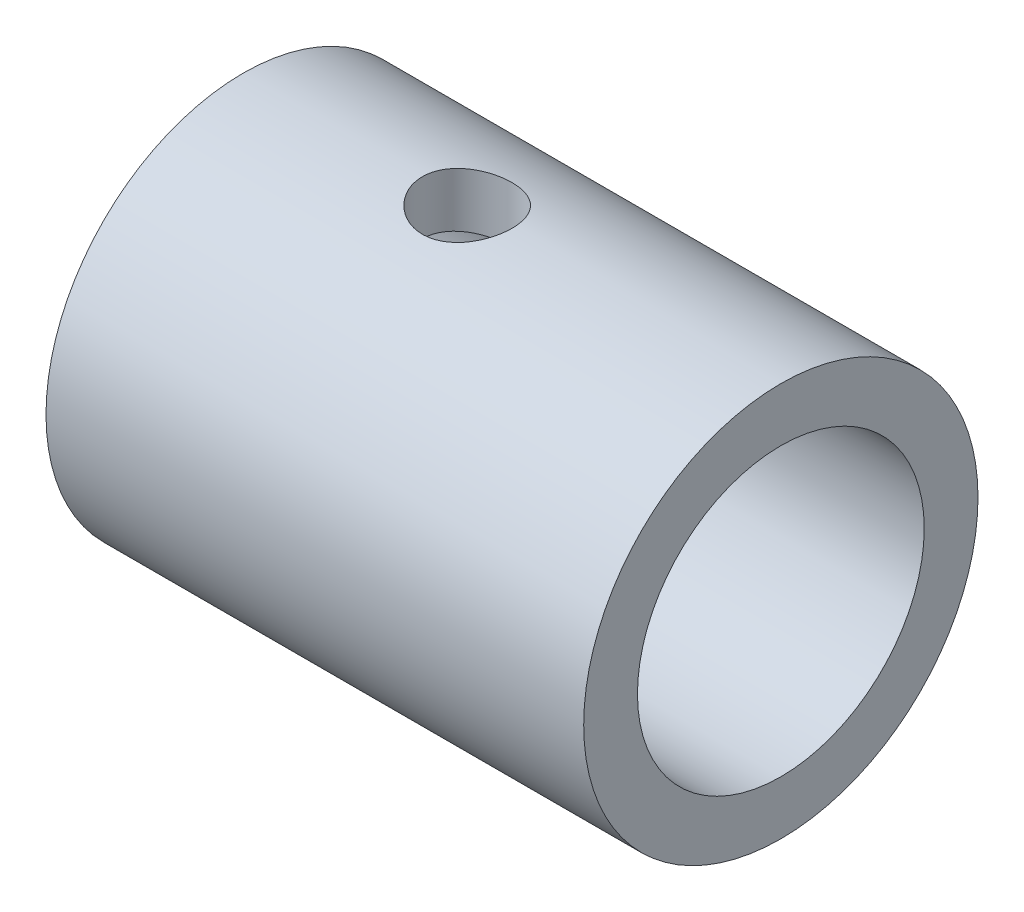
ISO-10303-21;
HEADER;
FILE_DESCRIPTION(('STEP AP214'),'2;1');
FILE_NAME('part.step','',(''),(''),'','','');
FILE_SCHEMA(('AUTOMOTIVE_DESIGN { 1 0 10303 214 1 1 1 1 }'));
ENDSEC;
DATA;
#1=APPLICATION_CONTEXT('core data for automotive mechanical design processes');
#2=APPLICATION_PROTOCOL_DEFINITION('international standard','automotive_design',2000,#1);
#3=PRODUCT_CONTEXT('',#1,'mechanical');
#4=PRODUCT('Part','Part','',(#3));
#5=PRODUCT_RELATED_PRODUCT_CATEGORY('part','',(#4));
#6=PRODUCT_DEFINITION_FORMATION('','',#4);
#7=PRODUCT_DEFINITION_CONTEXT('part definition',#1,'design');
#8=PRODUCT_DEFINITION('design','',#6,#7);
#9=PRODUCT_DEFINITION_SHAPE('','',#8);
#10=(LENGTH_UNIT() NAMED_UNIT(*) SI_UNIT(.MILLI.,.METRE.));
#11=(NAMED_UNIT(*) PLANE_ANGLE_UNIT() SI_UNIT($,.RADIAN.));
#12=(NAMED_UNIT(*) SI_UNIT($,.STERADIAN.) SOLID_ANGLE_UNIT());
#13=UNCERTAINTY_MEASURE_WITH_UNIT(LENGTH_MEASURE(1.E-05),#10,'distance_accuracy_value','');
#14=(GEOMETRIC_REPRESENTATION_CONTEXT(3) GLOBAL_UNCERTAINTY_ASSIGNED_CONTEXT((#13)) GLOBAL_UNIT_ASSIGNED_CONTEXT((#10,
#11,#12)) REPRESENTATION_CONTEXT('',''));
#15=CARTESIAN_POINT('',(0.,0.,0.));
#16=DIRECTION('',(0.,0.,1.));
#17=DIRECTION('',(1.,0.,0.));
#18=AXIS2_PLACEMENT_3D('',#15,#16,#17);
#19=CARTESIAN_POINT('',(-30.,0.,0.));
#20=DIRECTION('',(1.,0.,0.));
#21=DIRECTION('',(0.,0.,-1.));
#22=AXIS2_PLACEMENT_3D('',#19,#20,#21);
#23=CYLINDRICAL_SURFACE('',#22,11.);
#24=CARTESIAN_POINT('',(-30.,0.,0.));
#25=DIRECTION('',(1.,0.,0.));
#26=DIRECTION('',(0.,0.,-1.));
#27=AXIS2_PLACEMENT_3D('',#24,#25,#26);
#28=CIRCLE('',#27,11.);
#29=CARTESIAN_POINT('',(-30.,0.,-11.));
#30=VERTEX_POINT('',#29);
#31=EDGE_CURVE('E10',#30,#30,#28,.T.);
#32=ORIENTED_EDGE('',*,*,#31,.T.);
#33=EDGE_LOOP('',(#32));
#34=FACE_BOUND('',#33,.T.);
#35=CARTESIAN_POINT('',(0.,0.,0.));
#36=DIRECTION('',(1.,0.,0.));
#37=DIRECTION('',(0.,0.,-1.));
#38=AXIS2_PLACEMENT_3D('',#35,#36,#37);
#39=CIRCLE('',#38,11.);
#40=CARTESIAN_POINT('',(0.,0.,-11.));
#41=VERTEX_POINT('',#40);
#42=EDGE_CURVE('E44',#41,#41,#39,.T.);
#43=ORIENTED_EDGE('',*,*,#42,.F.);
#44=EDGE_LOOP('',(#43));
#45=FACE_BOUND('',#44,.T.);
#46=CARTESIAN_POINT('',(-15.,11.,0.));
#47=CARTESIAN_POINT('',(-15.0000045318264,10.9999974735185,0.138518278596904));
#48=CARTESIAN_POINT('',(-15.0115512275769,10.9973570934613,0.277090172258008));
#49=CARTESIAN_POINT('',(-15.0573794760617,10.987079320306,0.550288594599323));
#50=CARTESIAN_POINT('',(-15.0916763959553,10.9794385496265,0.68491239222073));
#51=CARTESIAN_POINT('',(-15.1818680486319,10.9600095312294,0.946227671984916));
#52=CARTESIAN_POINT('',(-15.2377393279807,10.9482257885674,1.07292759495647));
#53=CARTESIAN_POINT('',(-15.3694171133809,10.921778201627,1.31515227582566));
#54=CARTESIAN_POINT('',(-15.4452234208424,10.9071143860398,1.43067714503182));
#55=CARTESIAN_POINT('',(-15.6160020446067,10.8762265816814,1.64926760444638));
#56=CARTESIAN_POINT('',(-15.711252573475,10.8599819758326,1.75211293892049));
#57=CARTESIAN_POINT('',(-15.9176189741372,10.827906511833,1.9405138981661));
#58=CARTESIAN_POINT('',(-16.0287363506945,10.8120756930933,2.02606788121784));
#59=CARTESIAN_POINT('',(-16.2653320552837,10.7824158369221,2.17844599401787));
#60=CARTESIAN_POINT('',(-16.3909669963058,10.7686131580577,2.24503254356575));
#61=CARTESIAN_POINT('',(-16.6520095005816,10.7448696147509,2.3560606971787));
#62=CARTESIAN_POINT('',(-16.7874157920616,10.7349282488168,2.40050517717749));
#63=CARTESIAN_POINT('',(-17.0617591871165,10.7202434469831,2.46525349412718));
#64=CARTESIAN_POINT('',(-17.2005992631225,10.715415797339,2.48594892680754));
#65=CARTESIAN_POINT('',(-17.4798582272131,10.7112523406768,2.50382988451487));
#66=CARTESIAN_POINT('',(-17.6202769026623,10.711915802658,2.50101853886552));
#67=CARTESIAN_POINT('',(-17.8957728833487,10.7185835035919,2.47228016958762));
#68=CARTESIAN_POINT('',(-18.0309009061949,10.7244819412976,2.44681104599438));
#69=CARTESIAN_POINT('',(-18.2949144861548,10.7407873672743,2.37420684920502));
#70=CARTESIAN_POINT('',(-18.4237996676272,10.7511946264744,2.32707047404288));
#71=CARTESIAN_POINT('',(-18.6729406718105,10.7754474384537,2.21205734402544));
#72=CARTESIAN_POINT('',(-18.7931135177637,10.7893215597825,2.14400712086008));
#73=CARTESIAN_POINT('',(-19.0205025531111,10.8189276843241,1.98921977920408));
#74=CARTESIAN_POINT('',(-19.1277168402639,10.8346599596346,1.90247992237134));
#75=CARTESIAN_POINT('',(-19.328778561821,10.8666615287251,1.71036518003516));
#76=CARTESIAN_POINT('',(-19.4222544265163,10.882934773515,1.60460166742828));
#77=CARTESIAN_POINT('',(-19.5902058887071,10.9138502597158,1.37871229840972));
#78=CARTESIAN_POINT('',(-19.6646810866995,10.9284924668293,1.2585861400908));
#79=CARTESIAN_POINT('',(-19.7926203879715,10.9545497424637,1.00690799179916));
#80=CARTESIAN_POINT('',(-19.8460327736223,10.9659568484873,0.87532883434816));
#81=CARTESIAN_POINT('',(-19.9298840058679,10.9841998956698,0.6047451224917));
#82=CARTESIAN_POINT('',(-19.9603264658222,10.9910365557784,0.465741739663722));
#83=CARTESIAN_POINT('',(-19.9968262374727,10.9992650071756,0.187439840192734));
#84=CARTESIAN_POINT('',(-20.0033906913167,11.0007700184113,0.0482110923370396));
#85=CARTESIAN_POINT('',(-19.9933269601471,10.9984842255063,-0.229353886680102));
#86=CARTESIAN_POINT('',(-19.976700480594,10.9946938107912,-0.367690182720857));
#87=CARTESIAN_POINT('',(-19.9211468330946,10.9823148103741,-0.637841677218458));
#88=CARTESIAN_POINT('',(-19.8824884535563,10.973784087055,-0.769715036814425));
#89=CARTESIAN_POINT('',(-19.7842689725429,10.9528806132367,-1.0251039308776));
#90=CARTESIAN_POINT('',(-19.7247059957467,10.9405075180554,-1.14861871432289));
#91=CARTESIAN_POINT('',(-19.5853308564447,10.9130143275095,-1.38586085256056));
#92=CARTESIAN_POINT('',(-19.5052243732268,10.8978552985532,-1.49941068522719));
#93=CARTESIAN_POINT('',(-19.3274206715598,10.866546095646,-1.71163773579052));
#94=CARTESIAN_POINT('',(-19.2297209734532,10.8503957821912,-1.8103128535797));
#95=CARTESIAN_POINT('',(-19.0171690348666,10.8185287714487,-1.99201706218096));
#96=CARTESIAN_POINT('',(-18.9020127582132,10.8028272119253,-2.07469366594062));
#97=CARTESIAN_POINT('',(-18.6591536093297,10.7740023321604,-2.21953814406552));
#98=CARTESIAN_POINT('',(-18.5314512920404,10.7608788979592,-2.28170692501017));
#99=CARTESIAN_POINT('',(-18.2678195304311,10.7388274870674,-2.38333597241927));
#100=CARTESIAN_POINT('',(-18.1319426762567,10.7298753781702,-2.42292716221704));
#101=CARTESIAN_POINT('',(-17.8552330933009,10.7171411058581,-2.47865258340365));
#102=CARTESIAN_POINT('',(-17.7144012348636,10.7133580391079,-2.49479091341614));
#103=CARTESIAN_POINT('',(-17.4353413806891,10.7114502943222,-2.50296739214165));
#104=CARTESIAN_POINT('',(-17.2971304006664,10.7131941458177,-2.49556548501071));
#105=CARTESIAN_POINT('',(-17.0239810898117,10.7218446846914,-2.45813115403283));
#106=CARTESIAN_POINT('',(-16.8890427138895,10.7287513008948,-2.42809904217009));
#107=CARTESIAN_POINT('',(-16.6267566026337,10.7468826027048,-2.34653692360609));
#108=CARTESIAN_POINT('',(-16.4993803088585,10.758089666867,-2.29509457527995));
#109=CARTESIAN_POINT('',(-16.2549852930994,10.783564723281,-2.1722453660688));
#110=CARTESIAN_POINT('',(-16.1379677496745,10.7978330631966,-2.10083623731223));
#111=CARTESIAN_POINT('',(-15.9148655723447,10.828211072634,-1.93824996891049));
#112=CARTESIAN_POINT('',(-15.8090742777926,10.8443540558786,-1.84667645642834));
#113=CARTESIAN_POINT('',(-15.614176814918,10.8764454859305,-1.64715628932418));
#114=CARTESIAN_POINT('',(-15.525074529034,10.8923938866665,-1.53920583540676));
#115=CARTESIAN_POINT('',(-15.3648619397663,10.9225693389041,-1.30814060515057));
#116=CARTESIAN_POINT('',(-15.2940261766669,10.9367686161711,-1.1848316218762));
#117=CARTESIAN_POINT('',(-15.174200029337,10.9615640551399,-0.927755967711689));
#118=CARTESIAN_POINT('',(-15.1251920052133,10.9721631246672,-0.793997844337695));
#119=CARTESIAN_POINT('',(-15.0587720938239,10.9867559512784,-0.550163071539622));
#120=CARTESIAN_POINT('',(-15.0367760123107,10.9916908558499,-0.441368111138489));
#121=CARTESIAN_POINT('',(-15.0073885264207,10.9983138080738,-0.221726814930917));
#122=CARTESIAN_POINT('',(-14.9999963723808,11.0000020223883,-0.110880584717101));
#123=CARTESIAN_POINT('',(-15.,11.,0.));
#124=B_SPLINE_CURVE_WITH_KNOTS('',3,(#46,#47,#48,#49,#50,#51,#52,#53,#54,#55,#56,#57,#58,#59,
#60,#61,#62,#63,#64,#65,#66,#67,#68,#69,#70,#71,#72,#73,#74,#75,#76,#77,#78,#79,#80,#81,#82,#83,
#84,#85,#86,#87,#88,#89,#90,#91,#92,#93,#94,#95,#96,#97,#98,#99,#100,#101,#102,#103,#104,#105,
#106,#107,#108,#109,#110,#111,#112,#113,#114,#115,#116,#117,#118,#119,#120,#121,#122,#123),
.UNSPECIFIED.,.T.,.F.,(4,2,2,2,2,2,2,2,2,2,2,2,2,2,2,2,2,2,2,2,2,2,2,2,2,2,2,2,2,2,2,2,2,2,2,2,
2,2,4),(0.,0.415148849633315,0.830578406996929,1.24555761755318,1.66053269430525,
2.08192389396808,2.50335508365802,2.92985362973414,3.35629676538239,3.77560244898082,
4.19485231368757,4.60581714174235,5.01680666753971,5.4313015743885,5.84585725297978,
6.27011531803703,6.69438230269862,7.11968464096647,7.54492006169895,7.96106941916761,
8.37718817463627,8.78833576149035,9.19952024123082,9.61696129328767,10.0344612272567,
10.4603132154039,10.8861463755948,11.3094844190899,11.732748471094,12.1460204395145,
12.5592867105953,12.9708773657615,13.382514789318,13.8031102578591,14.2238034502007,
14.6504927745347,15.0768366452215,15.4091704772436,15.74148724914),.UNSPECIFIED.);
#125=CARTESIAN_POINT('',(-15.,11.,0.));
#126=VERTEX_POINT('',#125);
#127=EDGE_CURVE('E54',#126,#126,#124,.T.);
#128=ORIENTED_EDGE('',*,*,#127,.T.);
#129=EDGE_LOOP('',(#128));
#130=FACE_BOUND('',#129,.T.);
#131=ADVANCED_FACE('F32',(#34,#45,#130),#23,.T.);
#132=CARTESIAN_POINT('',(-30.,0.,0.));
#133=DIRECTION('',(1.,0.,0.));
#134=DIRECTION('',(0.,0.,-1.));
#135=AXIS2_PLACEMENT_3D('',#132,#133,#134);
#136=CYLINDRICAL_SURFACE('',#135,8.);
#137=CARTESIAN_POINT('',(0.,0.,0.));
#138=DIRECTION('',(1.,0.,0.));
#139=DIRECTION('',(0.,0.,-1.));
#140=AXIS2_PLACEMENT_3D('',#137,#138,#139);
#141=CIRCLE('',#140,8.);
#142=CARTESIAN_POINT('',(0.,0.,-8.));
#143=VERTEX_POINT('',#142);
#144=EDGE_CURVE('E51',#143,#143,#141,.T.);
#145=ORIENTED_EDGE('',*,*,#144,.T.);
#146=EDGE_LOOP('',(#145));
#147=FACE_BOUND('',#146,.T.);
#148=CARTESIAN_POINT('',(-30.,0.,0.));
#149=DIRECTION('',(1.,0.,0.));
#150=DIRECTION('',(0.,0.,-1.));
#151=AXIS2_PLACEMENT_3D('',#148,#149,#150);
#152=CIRCLE('',#151,8.);
#153=CARTESIAN_POINT('',(-30.,0.,-8.));
#154=VERTEX_POINT('',#153);
#155=EDGE_CURVE('E49',#154,#154,#152,.T.);
#156=ORIENTED_EDGE('',*,*,#155,.F.);
#157=EDGE_LOOP('',(#156));
#158=FACE_BOUND('',#157,.T.);
#159=CARTESIAN_POINT('',(-17.5,7.59934207678533,-2.5));
#160=CARTESIAN_POINT('',(-17.3633059277813,7.59934291923872,-2.49999907560094));
#161=CARTESIAN_POINT('',(-17.2266024625936,7.60307063010085,-2.48875077582989));
#162=CARTESIAN_POINT('',(-16.9572116782444,7.61751277997754,-2.44418350802654));
#163=CARTESIAN_POINT('',(-16.8245254545357,7.62822910706272,-2.4108585756503));
#164=CARTESIAN_POINT('',(-16.567110196136,7.65531877671919,-2.32339576447118));
#165=CARTESIAN_POINT('',(-16.4423675337886,7.67168210388633,-2.26929471473354));
#166=CARTESIAN_POINT('',(-16.203694608272,7.70820812437377,-2.14193828346314));
#167=CARTESIAN_POINT('',(-16.0897662600798,7.72837148871681,-2.06867951811264));
#168=CARTESIAN_POINT('',(-15.872042265013,7.7710025533724,-1.90239214124459));
#169=CARTESIAN_POINT('',(-15.768672781128,7.79352246769561,-1.8088187994408));
#170=CARTESIAN_POINT('',(-15.5788079735816,7.83788491720671,-1.60572409291099));
#171=CARTESIAN_POINT('',(-15.4923150061103,7.85972735745255,-1.49620050503713));
#172=CARTESIAN_POINT('',(-15.3367778739775,7.90087106780156,-1.26125182498673));
#173=CARTESIAN_POINT('',(-15.2681725923371,7.9201036912556,-1.13552311304019));
#174=CARTESIAN_POINT('',(-15.1532479002889,7.95325103666038,-0.873608465706807));
#175=CARTESIAN_POINT('',(-15.1069232517008,7.9671670083984,-0.737424996974104));
#176=CARTESIAN_POINT('',(-15.0392977438059,7.98774351641724,-0.462928713932197));
#177=CARTESIAN_POINT('',(-15.0172685004243,7.99461477968283,-0.324811430936433));
#178=CARTESIAN_POINT('',(-14.996551307125,8.00107191752033,-0.0466816279690394));
#179=CARTESIAN_POINT('',(-14.9978580512823,8.00065944820141,0.0933304539461725));
#180=CARTESIAN_POINT('',(-15.0232965831719,7.99274232265063,0.366148960709463));
#181=CARTESIAN_POINT('',(-15.046638767026,7.98548301944274,0.499037268628065));
#182=CARTESIAN_POINT('',(-15.114189980086,7.9649896512175,0.758906126695561));
#183=CARTESIAN_POINT('',(-15.1584003701732,7.95175519654419,0.885886290962471));
#184=CARTESIAN_POINT('',(-15.2669403781496,7.92046919458913,1.13215620630948));
#185=CARTESIAN_POINT('',(-15.3315096171255,7.90236067233341,1.25133281124536));
#186=CARTESIAN_POINT('',(-15.4787421994097,7.86323445907697,1.47740502230436));
#187=CARTESIAN_POINT('',(-15.5614101182777,7.84221603291309,1.58429751241882));
#188=CARTESIAN_POINT('',(-15.7465472696004,7.79847341467064,1.78747539690657));
#189=CARTESIAN_POINT('',(-15.8496981376742,7.77571463969686,1.88313309818382));
#190=CARTESIAN_POINT('',(-16.0707902036571,7.73181230889308,2.05597948519529));
#191=CARTESIAN_POINT('',(-16.1887331411807,7.71066894351396,2.13316599552377));
#192=CARTESIAN_POINT('',(-16.4378349376951,7.6722169326579,2.26760930038169));
#193=CARTESIAN_POINT('',(-16.5691268179819,7.65495380588194,2.32463361399527));
#194=CARTESIAN_POINT('',(-16.840118983684,7.62675090557699,2.41556691891091));
#195=CARTESIAN_POINT('',(-16.9798162283887,7.61580886035023,2.44948421530003));
#196=CARTESIAN_POINT('',(-17.2576399051543,7.60199126814082,2.4920297037281));
#197=CARTESIAN_POINT('',(-17.3956039924703,7.59880932787513,2.50161908707794));
#198=CARTESIAN_POINT('',(-17.6711794829903,7.6000215491985,2.49793488996242));
#199=CARTESIAN_POINT('',(-17.8087909373993,7.60441454014633,2.48466484222813));
#200=CARTESIAN_POINT('',(-18.0756165933048,7.61997914967832,2.43649747026382));
#201=CARTESIAN_POINT('',(-18.2049585481484,7.63095108204022,2.40223662321101));
#202=CARTESIAN_POINT('',(-18.4560435839917,7.65822574662762,2.31380747322029));
#203=CARTESIAN_POINT('',(-18.5777854218423,7.67452934824624,2.25963592342302));
#204=CARTESIAN_POINT('',(-18.8140782195436,7.71121079306468,2.13115021311757));
#205=CARTESIAN_POINT('',(-18.9283228311856,7.73169206979508,2.05630294977117));
#206=CARTESIAN_POINT('',(-19.1429806927238,7.77420697945615,1.8892128173596));
#207=CARTESIAN_POINT('',(-19.2433903378507,7.79624101471394,1.79696542938156));
#208=CARTESIAN_POINT('',(-19.4318207318256,7.84048375125371,1.59314589550721));
#209=CARTESIAN_POINT('',(-19.5191555722797,7.86266184571362,1.48093129957704));
#210=CARTESIAN_POINT('',(-19.6737820866425,7.90378119687353,1.24290309130279));
#211=CARTESIAN_POINT('',(-19.7410746786221,7.92272260181891,1.11709010221725));
#212=CARTESIAN_POINT('',(-19.8530611249434,7.95512623857025,0.856211046663662));
#213=CARTESIAN_POINT('',(-19.8979185756874,7.968627991224,0.72122036856751));
#214=CARTESIAN_POINT('',(-19.9641450771794,7.98880485297153,0.445114508112778));
#215=CARTESIAN_POINT('',(-19.985521478167,7.99548209828555,0.304001256680713));
#216=CARTESIAN_POINT('',(-20.0035820034992,8.00111606808923,0.0259698732977984));
#217=CARTESIAN_POINT('',(-20.0012569003415,8.0003825881478,-0.110878383893044));
#218=CARTESIAN_POINT('',(-19.9743763779026,7.99201956162097,-0.382146443846496));
#219=CARTESIAN_POINT('',(-19.9498224080161,7.98439046465238,-0.516566404359137));
#220=CARTESIAN_POINT('',(-19.8798119815554,7.96319141689591,-0.777510236961583));
#221=CARTESIAN_POINT('',(-19.8346207843093,7.9496969592041,-0.904111836898962));
#222=CARTESIAN_POINT('',(-19.724858345583,7.918158911759,-1.14799685100018));
#223=CARTESIAN_POINT('',(-19.6602837800531,7.90011454182716,-1.26527866254896));
#224=CARTESIAN_POINT('',(-19.5110544833111,7.86059793766752,-1.49152338993938));
#225=CARTESIAN_POINT('',(-19.4257929550721,7.83903019501924,-1.60006921410622));
#226=CARTESIAN_POINT('',(-19.2386802211131,7.79517473094122,-1.80164158279864));
#227=CARTESIAN_POINT('',(-19.1368240517212,7.77288679569653,-1.89466346700832));
#228=CARTESIAN_POINT('',(-18.9153685603178,7.72923785154876,-2.06565731822505));
#229=CARTESIAN_POINT('',(-18.7952931937669,7.70793201726912,-2.14302855989422));
#230=CARTESIAN_POINT('',(-18.5432037594617,7.66960250559062,-2.27640941497043));
#231=CARTESIAN_POINT('',(-18.4111945470995,7.65257709722773,-2.33242766807092));
#232=CARTESIAN_POINT('',(-18.1505547653707,7.62613120880655,-2.41742360871585));
#233=CARTESIAN_POINT('',(-18.0225949050969,7.61618630087498,-2.44829879675747));
#234=CARTESIAN_POINT('',(-17.763092335807,7.60279212964797,-2.48958491632199));
#235=CARTESIAN_POINT('',(-17.631550517597,7.59934126603196,-2.50000088961557));
#236=CARTESIAN_POINT('',(-17.5,7.59934207678533,-2.5));
#237=B_SPLINE_CURVE_WITH_KNOTS('',3,(#159,#160,#161,#162,#163,#164,#165,#166,#167,#168,#169,
#170,#171,#172,#173,#174,#175,#176,#177,#178,#179,#180,#181,#182,#183,#184,#185,#186,#187,#188,
#189,#190,#191,#192,#193,#194,#195,#196,#197,#198,#199,#200,#201,#202,#203,#204,#205,#206,#207,
#208,#209,#210,#211,#212,#213,#214,#215,#216,#217,#218,#219,#220,#221,#222,#223,#224,#225,#226,
#227,#228,#229,#230,#231,#232,#233,#234,#235,#236),.UNSPECIFIED.,.T.,.F.,(4,2,2,2,2,2,2,2,2,2,2,
2,2,2,2,2,2,2,2,2,2,2,2,2,2,2,2,2,2,2,2,2,2,2,2,2,2,2,4),(0.,0.409596275096977,
0.819303254119471,1.22828728823716,1.6373436098499,2.05914161101676,2.48099845882245,
2.91239643927466,3.34369294835844,3.76167445671067,4.17956092943549,4.58301965939501,
4.98650470380186,5.39492809216818,5.80345485426375,6.22900677874668,6.65460879707552,
7.08496941871143,7.51517527910369,7.92809866580735,8.34095824443042,8.7418794409359,
9.14286604511284,9.55535226624085,9.96794576028624,10.3976387562789,10.8273120663904,
11.2538047858686,11.6801639628603,12.0887760488391,12.4973614938948,12.9008369303438,
13.3043815982817,13.7216138621529,14.1389711554924,14.5701559100827,15.0011660161251,
15.3954470874764,15.7896309838242),.UNSPECIFIED.);
#238=CARTESIAN_POINT('',(-17.5,7.59934207678533,-2.5));
#239=VERTEX_POINT('',#238);
#240=EDGE_CURVE('E36',#239,#239,#237,.T.);
#241=ORIENTED_EDGE('',*,*,#240,.F.);
#242=EDGE_LOOP('',(#241));
#243=FACE_BOUND('',#242,.T.);
#244=ADVANCED_FACE('F65',(#147,#158,#243),#136,.F.);
#245=CARTESIAN_POINT('',(-30.,0.,0.));
#246=DIRECTION('',(1.,0.,0.));
#247=DIRECTION('',(0.,0.,-1.));
#248=AXIS2_PLACEMENT_3D('',#245,#246,#247);
#249=PLANE('',#248);
#250=ORIENTED_EDGE('',*,*,#155,.T.);
#251=EDGE_LOOP('',(#250));
#252=FACE_BOUND('',#251,.T.);
#253=ORIENTED_EDGE('',*,*,#31,.F.);
#254=EDGE_LOOP('',(#253));
#255=FACE_BOUND('',#254,.T.);
#256=ADVANCED_FACE('F70',(#252,#255),#249,.F.);
#257=CARTESIAN_POINT('',(0.,0.,0.));
#258=DIRECTION('',(1.,0.,0.));
#259=DIRECTION('',(0.,0.,-1.));
#260=AXIS2_PLACEMENT_3D('',#257,#258,#259);
#261=PLANE('',#260);
#262=ORIENTED_EDGE('',*,*,#144,.F.);
#263=EDGE_LOOP('',(#262));
#264=FACE_BOUND('',#263,.T.);
#265=ORIENTED_EDGE('',*,*,#42,.T.);
#266=EDGE_LOOP('',(#265));
#267=FACE_BOUND('',#266,.T.);
#268=ADVANCED_FACE('F63',(#264,#267),#261,.T.);
#269=CARTESIAN_POINT('',(-17.5,11.,0.));
#270=DIRECTION('',(0.,-1.,0.));
#271=DIRECTION('',(0.,0.,-1.));
#272=AXIS2_PLACEMENT_3D('',#269,#270,#271);
#273=CYLINDRICAL_SURFACE('',#272,2.5);
#274=ORIENTED_EDGE('',*,*,#127,.F.);
#275=EDGE_LOOP('',(#274));
#276=FACE_BOUND('',#275,.T.);
#277=ORIENTED_EDGE('',*,*,#240,.T.);
#278=EDGE_LOOP('',(#277));
#279=FACE_BOUND('',#278,.T.);
#280=ADVANCED_FACE('F60',(#276,#279),#273,.F.);
#281=CLOSED_SHELL('',(#131,#244,#256,#268,#280));
#282=MANIFOLD_SOLID_BREP('B2',#281);
#283=ADVANCED_BREP_SHAPE_REPRESENTATION('',(#18,#282),#14);
#284=SHAPE_DEFINITION_REPRESENTATION(#9,#283);
ENDSEC;
END-ISO-10303-21;
